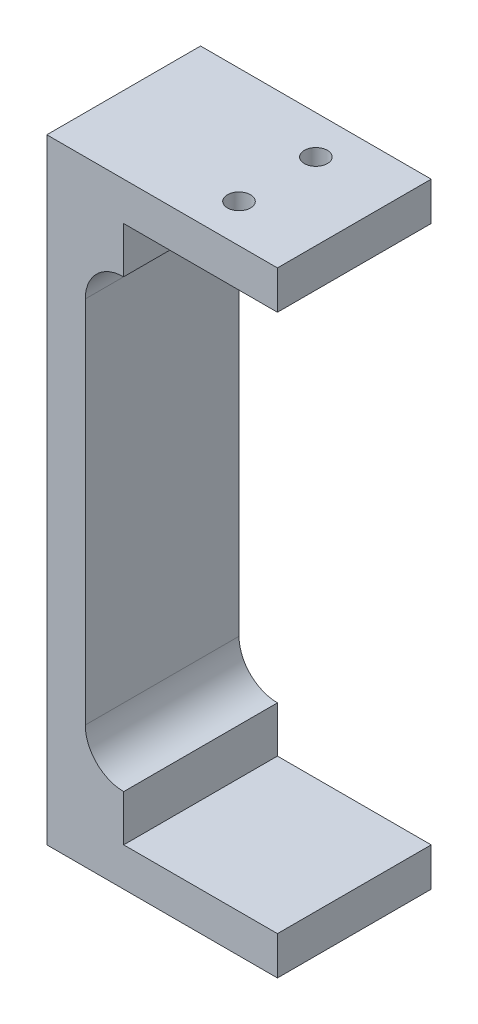
ISO-10303-21;
HEADER;
FILE_DESCRIPTION(('STEP AP214'),'2;1');
FILE_NAME('part.step','',(''),(''),'','','');
FILE_SCHEMA(('AUTOMOTIVE_DESIGN { 1 0 10303 214 1 1 1 1 }'));
ENDSEC;
DATA;
#1=APPLICATION_CONTEXT('core data for automotive mechanical design processes');
#2=APPLICATION_PROTOCOL_DEFINITION('international standard','automotive_design',2000,#1);
#3=PRODUCT_CONTEXT('',#1,'mechanical');
#4=PRODUCT('Part','Part','',(#3));
#5=PRODUCT_RELATED_PRODUCT_CATEGORY('part','',(#4));
#6=PRODUCT_DEFINITION_FORMATION('','',#4);
#7=PRODUCT_DEFINITION_CONTEXT('part definition',#1,'design');
#8=PRODUCT_DEFINITION('design','',#6,#7);
#9=PRODUCT_DEFINITION_SHAPE('','',#8);
#10=(LENGTH_UNIT() NAMED_UNIT(*) SI_UNIT(.MILLI.,.METRE.));
#11=(NAMED_UNIT(*) PLANE_ANGLE_UNIT() SI_UNIT($,.RADIAN.));
#12=(NAMED_UNIT(*) SI_UNIT($,.STERADIAN.) SOLID_ANGLE_UNIT());
#13=UNCERTAINTY_MEASURE_WITH_UNIT(LENGTH_MEASURE(1.E-05),#10,'distance_accuracy_value','');
#14=(GEOMETRIC_REPRESENTATION_CONTEXT(3) GLOBAL_UNCERTAINTY_ASSIGNED_CONTEXT((#13)) GLOBAL_UNIT_ASSIGNED_CONTEXT((#10,
#11,#12)) REPRESENTATION_CONTEXT('',''));
#15=CARTESIAN_POINT('',(0.,0.,0.));
#16=DIRECTION('',(0.,0.,1.));
#17=DIRECTION('',(1.,0.,0.));
#18=AXIS2_PLACEMENT_3D('',#15,#16,#17);
#19=CARTESIAN_POINT('',(20.,-75.,20.));
#20=DIRECTION('',(0.,-1.,0.));
#21=DIRECTION('',(0.,0.,-1.));
#22=AXIS2_PLACEMENT_3D('',#19,#20,#21);
#23=PLANE('',#22);
#24=DIRECTION('',(0.,0.,-1.));
#25=VECTOR('',#24,1.);
#26=CARTESIAN_POINT('',(0.,-75.,20.));
#27=LINE('',#26,#25);
#28=CARTESIAN_POINT('',(0.,-75.,20.));
#29=VERTEX_POINT('',#28);
#30=CARTESIAN_POINT('',(0.,-75.,0.));
#31=VERTEX_POINT('',#30);
#32=EDGE_CURVE('E54',#29,#31,#27,.T.);
#33=ORIENTED_EDGE('',*,*,#32,.F.);
#34=DIRECTION('',(-1.,0.,0.));
#35=VECTOR('',#34,1.);
#36=CARTESIAN_POINT('',(20.,-75.,20.));
#37=LINE('',#36,#35);
#38=CARTESIAN_POINT('',(20.,-75.,20.));
#39=VERTEX_POINT('',#38);
#40=EDGE_CURVE('E134',#39,#29,#37,.T.);
#41=ORIENTED_EDGE('',*,*,#40,.F.);
#42=DIRECTION('',(0.,0.,-1.));
#43=VECTOR('',#42,1.);
#44=CARTESIAN_POINT('',(20.,-75.,20.));
#45=LINE('',#44,#43);
#46=CARTESIAN_POINT('',(20.,-75.,0.));
#47=VERTEX_POINT('',#46);
#48=EDGE_CURVE('E211',#39,#47,#45,.T.);
#49=ORIENTED_EDGE('',*,*,#48,.T.);
#50=DIRECTION('',(-1.,0.,0.));
#51=VECTOR('',#50,1.);
#52=CARTESIAN_POINT('',(20.,-75.,0.));
#53=LINE('',#52,#51);
#54=EDGE_CURVE('E204',#47,#31,#53,.T.);
#55=ORIENTED_EDGE('',*,*,#54,.T.);
#56=EDGE_LOOP('',(#33,#41,#49,#55));
#57=FACE_BOUND('',#56,.T.);
#58=ADVANCED_FACE('F39',(#57),#23,.F.);
#59=CARTESIAN_POINT('',(-5.,-75.,20.));
#60=DIRECTION('',(-1.,0.,0.));
#61=DIRECTION('',(0.,0.,1.));
#62=AXIS2_PLACEMENT_3D('',#59,#60,#61);
#63=PLANE('',#62);
#64=DIRECTION('',(0.,1.,0.));
#65=VECTOR('',#64,1.);
#66=CARTESIAN_POINT('',(-5.,-75.,20.));
#67=LINE('',#66,#65);
#68=CARTESIAN_POINT('',(-5.,-64.,20.));
#69=VERTEX_POINT('',#68);
#70=CARTESIAN_POINT('',(-5.,-16.,20.));
#71=VERTEX_POINT('',#70);
#72=EDGE_CURVE('E62',#69,#71,#67,.T.);
#73=ORIENTED_EDGE('',*,*,#72,.F.);
#74=DIRECTION('',(0.,0.,-1.));
#75=VECTOR('',#74,1.);
#76=CARTESIAN_POINT('',(-5.,-64.,20.));
#77=LINE('',#76,#75);
#78=CARTESIAN_POINT('',(-5.,-64.,0.));
#79=VERTEX_POINT('',#78);
#80=EDGE_CURVE('E146',#69,#79,#77,.T.);
#81=ORIENTED_EDGE('',*,*,#80,.T.);
#82=DIRECTION('',(0.,1.,0.));
#83=VECTOR('',#82,1.);
#84=CARTESIAN_POINT('',(-5.,-75.,0.));
#85=LINE('',#84,#83);
#86=CARTESIAN_POINT('',(-5.,-16.,0.));
#87=VERTEX_POINT('',#86);
#88=EDGE_CURVE('E206',#79,#87,#85,.T.);
#89=ORIENTED_EDGE('',*,*,#88,.T.);
#90=DIRECTION('',(0.,0.,-1.));
#91=VECTOR('',#90,1.);
#92=CARTESIAN_POINT('',(-5.,-16.,20.));
#93=LINE('',#92,#91);
#94=EDGE_CURVE('E173',#71,#87,#93,.T.);
#95=ORIENTED_EDGE('',*,*,#94,.F.);
#96=EDGE_LOOP('',(#73,#81,#89,#95));
#97=FACE_BOUND('',#96,.T.);
#98=ADVANCED_FACE('F259',(#97),#63,.F.);
#99=CARTESIAN_POINT('',(-5.,-5.,20.));
#100=DIRECTION('',(0.,1.,0.));
#101=DIRECTION('',(0.,0.,1.));
#102=AXIS2_PLACEMENT_3D('',#99,#100,#101);
#103=PLANE('',#102);
#104=CARTESIAN_POINT('',(9.99999999999999,-5.,5.));
#105=DIRECTION('',(0.,1.,0.));
#106=DIRECTION('',(0.,0.,1.));
#107=AXIS2_PLACEMENT_3D('',#104,#105,#106);
#108=CIRCLE('',#107,1.5);
#109=CARTESIAN_POINT('',(9.99999999999999,-5.,6.5));
#110=VERTEX_POINT('',#109);
#111=EDGE_CURVE('E154',#110,#110,#108,.F.);
#112=ORIENTED_EDGE('',*,*,#111,.F.);
#113=EDGE_LOOP('',(#112));
#114=FACE_BOUND('',#113,.T.);
#115=CARTESIAN_POINT('',(9.99999999999999,-5.,15.));
#116=DIRECTION('',(0.,1.,0.));
#117=DIRECTION('',(0.,0.,1.));
#118=AXIS2_PLACEMENT_3D('',#115,#116,#117);
#119=CIRCLE('',#118,1.5);
#120=CARTESIAN_POINT('',(9.99999999999999,-5.,16.5));
#121=VERTEX_POINT('',#120);
#122=EDGE_CURVE('E289',#121,#121,#119,.F.);
#123=ORIENTED_EDGE('',*,*,#122,.F.);
#124=EDGE_LOOP('',(#123));
#125=FACE_BOUND('',#124,.T.);
#126=DIRECTION('',(0.,0.,-1.));
#127=VECTOR('',#126,1.);
#128=CARTESIAN_POINT('',(0.,-5.,20.));
#129=LINE('',#128,#127);
#130=CARTESIAN_POINT('',(0.,-5.,20.));
#131=VERTEX_POINT('',#130);
#132=CARTESIAN_POINT('',(0.,-5.,0.));
#133=VERTEX_POINT('',#132);
#134=EDGE_CURVE('E164',#131,#133,#129,.T.);
#135=ORIENTED_EDGE('',*,*,#134,.T.);
#136=DIRECTION('',(1.,0.,0.));
#137=VECTOR('',#136,1.);
#138=CARTESIAN_POINT('',(-5.,-5.,0.));
#139=LINE('',#138,#137);
#140=CARTESIAN_POINT('',(20.,-5.,0.));
#141=VERTEX_POINT('',#140);
#142=EDGE_CURVE('E181',#133,#141,#139,.T.);
#143=ORIENTED_EDGE('',*,*,#142,.T.);
#144=DIRECTION('',(0.,0.,-1.));
#145=VECTOR('',#144,1.);
#146=CARTESIAN_POINT('',(20.,-5.,20.));
#147=LINE('',#146,#145);
#148=CARTESIAN_POINT('',(20.,-5.,20.));
#149=VERTEX_POINT('',#148);
#150=EDGE_CURVE('E193',#149,#141,#147,.T.);
#151=ORIENTED_EDGE('',*,*,#150,.F.);
#152=DIRECTION('',(1.,0.,0.));
#153=VECTOR('',#152,1.);
#154=CARTESIAN_POINT('',(-5.,-5.,20.));
#155=LINE('',#154,#153);
#156=EDGE_CURVE('E191',#131,#149,#155,.T.);
#157=ORIENTED_EDGE('',*,*,#156,.F.);
#158=EDGE_LOOP('',(#135,#143,#151,#157));
#159=FACE_BOUND('',#158,.T.);
#160=ADVANCED_FACE('F251',(#114,#125,#159),#103,.F.);
#161=CARTESIAN_POINT('',(20.,-5.,20.));
#162=DIRECTION('',(-1.,0.,0.));
#163=DIRECTION('',(0.,0.,1.));
#164=AXIS2_PLACEMENT_3D('',#161,#162,#163);
#165=PLANE('',#164);
#166=DIRECTION('',(0.,1.,0.));
#167=VECTOR('',#166,1.);
#168=CARTESIAN_POINT('',(20.,-5.,0.));
#169=LINE('',#168,#167);
#170=CARTESIAN_POINT('',(20.,0.,0.));
#171=VERTEX_POINT('',#170);
#172=EDGE_CURVE('E176',#141,#171,#169,.T.);
#173=ORIENTED_EDGE('',*,*,#172,.T.);
#174=DIRECTION('',(0.,0.,-1.));
#175=VECTOR('',#174,1.);
#176=CARTESIAN_POINT('',(20.,0.,20.));
#177=LINE('',#176,#175);
#178=CARTESIAN_POINT('',(20.,0.,20.));
#179=VERTEX_POINT('',#178);
#180=EDGE_CURVE('E11',#179,#171,#177,.T.);
#181=ORIENTED_EDGE('',*,*,#180,.F.);
#182=DIRECTION('',(0.,1.,0.));
#183=VECTOR('',#182,1.);
#184=CARTESIAN_POINT('',(20.,-5.,20.));
#185=LINE('',#184,#183);
#186=EDGE_CURVE('E177',#149,#179,#185,.T.);
#187=ORIENTED_EDGE('',*,*,#186,.F.);
#188=ORIENTED_EDGE('',*,*,#150,.T.);
#189=EDGE_LOOP('',(#173,#181,#187,#188));
#190=FACE_BOUND('',#189,.T.);
#191=ADVANCED_FACE('F41',(#190),#165,.F.);
#192=CARTESIAN_POINT('',(20.,0.,20.));
#193=DIRECTION('',(0.,-1.,0.));
#194=DIRECTION('',(1.,0.,0.));
#195=AXIS2_PLACEMENT_3D('',#192,#193,#194);
#196=PLANE('',#195);
#197=CARTESIAN_POINT('',(9.99999999999999,0.,5.));
#198=DIRECTION('',(0.,1.,0.));
#199=DIRECTION('',(0.,0.,1.));
#200=AXIS2_PLACEMENT_3D('',#197,#198,#199);
#201=CIRCLE('',#200,1.5);
#202=CARTESIAN_POINT('',(9.99999999999999,0.,6.5));
#203=VERTEX_POINT('',#202);
#204=EDGE_CURVE('E284',#203,#203,#201,.T.);
#205=ORIENTED_EDGE('',*,*,#204,.F.);
#206=EDGE_LOOP('',(#205));
#207=FACE_BOUND('',#206,.T.);
#208=CARTESIAN_POINT('',(9.99999999999999,0.,15.));
#209=DIRECTION('',(0.,1.,0.));
#210=DIRECTION('',(0.,0.,1.));
#211=AXIS2_PLACEMENT_3D('',#208,#209,#210);
#212=CIRCLE('',#211,1.5);
#213=CARTESIAN_POINT('',(9.99999999999999,0.,16.5));
#214=VERTEX_POINT('',#213);
#215=EDGE_CURVE('E287',#214,#214,#212,.T.);
#216=ORIENTED_EDGE('',*,*,#215,.F.);
#217=EDGE_LOOP('',(#216));
#218=FACE_BOUND('',#217,.T.);
#219=DIRECTION('',(-1.,0.,0.));
#220=VECTOR('',#219,1.);
#221=CARTESIAN_POINT('',(20.,0.,0.));
#222=LINE('',#221,#220);
#223=CARTESIAN_POINT('',(-10.,0.,0.));
#224=VERTEX_POINT('',#223);
#225=EDGE_CURVE('E196',#171,#224,#222,.T.);
#226=ORIENTED_EDGE('',*,*,#225,.T.);
#227=DIRECTION('',(0.,0.,-1.));
#228=VECTOR('',#227,1.);
#229=CARTESIAN_POINT('',(-10.,0.,20.));
#230=LINE('',#229,#228);
#231=CARTESIAN_POINT('',(-10.,0.,20.));
#232=VERTEX_POINT('',#231);
#233=EDGE_CURVE('E47',#232,#224,#230,.T.);
#234=ORIENTED_EDGE('',*,*,#233,.F.);
#235=DIRECTION('',(-1.,0.,0.));
#236=VECTOR('',#235,1.);
#237=CARTESIAN_POINT('',(20.,0.,20.));
#238=LINE('',#237,#236);
#239=EDGE_CURVE('E180',#179,#232,#238,.T.);
#240=ORIENTED_EDGE('',*,*,#239,.F.);
#241=ORIENTED_EDGE('',*,*,#180,.T.);
#242=EDGE_LOOP('',(#226,#234,#240,#241));
#243=FACE_BOUND('',#242,.T.);
#244=ADVANCED_FACE('F244',(#207,#218,#243),#196,.F.);
#245=CARTESIAN_POINT('',(-10.,0.,20.));
#246=DIRECTION('',(1.,0.,0.));
#247=DIRECTION('',(0.,1.,0.));
#248=AXIS2_PLACEMENT_3D('',#245,#246,#247);
#249=PLANE('',#248);
#250=DIRECTION('',(0.,-1.,0.));
#251=VECTOR('',#250,1.);
#252=CARTESIAN_POINT('',(-10.,0.,0.));
#253=LINE('',#252,#251);
#254=CARTESIAN_POINT('',(-9.99999999999999,-80.,0.));
#255=VERTEX_POINT('',#254);
#256=EDGE_CURVE('E198',#224,#255,#253,.T.);
#257=ORIENTED_EDGE('',*,*,#256,.T.);
#258=DIRECTION('',(0.,0.,-1.));
#259=VECTOR('',#258,1.);
#260=CARTESIAN_POINT('',(-9.99999999999999,-80.,20.));
#261=LINE('',#260,#259);
#262=CARTESIAN_POINT('',(-9.99999999999999,-80.,20.));
#263=VERTEX_POINT('',#262);
#264=EDGE_CURVE('E217',#263,#255,#261,.T.);
#265=ORIENTED_EDGE('',*,*,#264,.F.);
#266=DIRECTION('',(0.,-1.,0.));
#267=VECTOR('',#266,1.);
#268=CARTESIAN_POINT('',(-10.,0.,20.));
#269=LINE('',#268,#267);
#270=EDGE_CURVE('E183',#232,#263,#269,.T.);
#271=ORIENTED_EDGE('',*,*,#270,.F.);
#272=ORIENTED_EDGE('',*,*,#233,.T.);
#273=EDGE_LOOP('',(#257,#265,#271,#272));
#274=FACE_BOUND('',#273,.T.);
#275=ADVANCED_FACE('F224',(#274),#249,.F.);
#276=CARTESIAN_POINT('',(-9.99999999999999,-80.,20.));
#277=DIRECTION('',(0.,1.,0.));
#278=DIRECTION('',(0.,0.,1.));
#279=AXIS2_PLACEMENT_3D('',#276,#277,#278);
#280=PLANE('',#279);
#281=DIRECTION('',(1.,0.,0.));
#282=VECTOR('',#281,1.);
#283=CARTESIAN_POINT('',(-9.99999999999999,-80.,0.));
#284=LINE('',#283,#282);
#285=CARTESIAN_POINT('',(20.,-80.,0.));
#286=VERTEX_POINT('',#285);
#287=EDGE_CURVE('E200',#255,#286,#284,.T.);
#288=ORIENTED_EDGE('',*,*,#287,.T.);
#289=DIRECTION('',(0.,0.,-1.));
#290=VECTOR('',#289,1.);
#291=CARTESIAN_POINT('',(20.,-80.,20.));
#292=LINE('',#291,#290);
#293=CARTESIAN_POINT('',(20.,-80.,20.));
#294=VERTEX_POINT('',#293);
#295=EDGE_CURVE('E214',#294,#286,#292,.T.);
#296=ORIENTED_EDGE('',*,*,#295,.F.);
#297=DIRECTION('',(1.,0.,0.));
#298=VECTOR('',#297,1.);
#299=CARTESIAN_POINT('',(-9.99999999999999,-80.,20.));
#300=LINE('',#299,#298);
#301=EDGE_CURVE('E185',#263,#294,#300,.T.);
#302=ORIENTED_EDGE('',*,*,#301,.F.);
#303=ORIENTED_EDGE('',*,*,#264,.T.);
#304=EDGE_LOOP('',(#288,#296,#302,#303));
#305=FACE_BOUND('',#304,.T.);
#306=ADVANCED_FACE('F236',(#305),#280,.F.);
#307=CARTESIAN_POINT('',(20.,-80.,20.));
#308=DIRECTION('',(-1.,0.,0.));
#309=DIRECTION('',(0.,0.,1.));
#310=AXIS2_PLACEMENT_3D('',#307,#308,#309);
#311=PLANE('',#310);
#312=DIRECTION('',(0.,1.,0.));
#313=VECTOR('',#312,1.);
#314=CARTESIAN_POINT('',(20.,-80.,0.));
#315=LINE('',#314,#313);
#316=EDGE_CURVE('E202',#286,#47,#315,.T.);
#317=ORIENTED_EDGE('',*,*,#316,.T.);
#318=ORIENTED_EDGE('',*,*,#48,.F.);
#319=DIRECTION('',(0.,1.,0.));
#320=VECTOR('',#319,1.);
#321=CARTESIAN_POINT('',(20.,-80.,20.));
#322=LINE('',#321,#320);
#323=EDGE_CURVE('E187',#294,#39,#322,.T.);
#324=ORIENTED_EDGE('',*,*,#323,.F.);
#325=ORIENTED_EDGE('',*,*,#295,.T.);
#326=EDGE_LOOP('',(#317,#318,#324,#325));
#327=FACE_BOUND('',#326,.T.);
#328=ADVANCED_FACE('F240',(#327),#311,.F.);
#329=CARTESIAN_POINT('',(0.,0.,20.));
#330=DIRECTION('',(0.,0.,1.));
#331=DIRECTION('',(1.,0.,0.));
#332=AXIS2_PLACEMENT_3D('',#329,#330,#331);
#333=PLANE('',#332);
#334=CARTESIAN_POINT('',(0.,-64.,20.));
#335=DIRECTION('',(0.,0.,-1.));
#336=DIRECTION('',(-1.,0.,0.));
#337=AXIS2_PLACEMENT_3D('',#334,#335,#336);
#338=CIRCLE('',#337,5.);
#339=CARTESIAN_POINT('',(0.,-69.,20.));
#340=VERTEX_POINT('',#339);
#341=EDGE_CURVE('E132',#340,#69,#338,.T.);
#342=ORIENTED_EDGE('',*,*,#341,.T.);
#343=ORIENTED_EDGE('',*,*,#72,.T.);
#344=CARTESIAN_POINT('',(0.,-16.,20.));
#345=DIRECTION('',(0.,0.,-1.));
#346=DIRECTION('',(1.,0.,0.));
#347=AXIS2_PLACEMENT_3D('',#344,#345,#346);
#348=CIRCLE('',#347,5.);
#349=CARTESIAN_POINT('',(0.,-11.,20.));
#350=VERTEX_POINT('',#349);
#351=EDGE_CURVE('E158',#71,#350,#348,.T.);
#352=ORIENTED_EDGE('',*,*,#351,.T.);
#353=DIRECTION('',(0.,1.,0.));
#354=VECTOR('',#353,1.);
#355=CARTESIAN_POINT('',(0.,-5.,20.));
#356=LINE('',#355,#354);
#357=EDGE_CURVE('E160',#350,#131,#356,.T.);
#358=ORIENTED_EDGE('',*,*,#357,.T.);
#359=ORIENTED_EDGE('',*,*,#156,.T.);
#360=ORIENTED_EDGE('',*,*,#186,.T.);
#361=ORIENTED_EDGE('',*,*,#239,.T.);
#362=ORIENTED_EDGE('',*,*,#270,.T.);
#363=ORIENTED_EDGE('',*,*,#301,.T.);
#364=ORIENTED_EDGE('',*,*,#323,.T.);
#365=ORIENTED_EDGE('',*,*,#40,.T.);
#366=DIRECTION('',(0.,1.,0.));
#367=VECTOR('',#366,1.);
#368=CARTESIAN_POINT('',(0.,-75.,20.));
#369=LINE('',#368,#367);
#370=EDGE_CURVE('E128',#29,#340,#369,.T.);
#371=ORIENTED_EDGE('',*,*,#370,.T.);
#372=EDGE_LOOP('',(#342,#343,#352,#358,#359,#360,#361,#362,#363,#364,#365,#371));
#373=FACE_BOUND('',#372,.T.);
#374=ADVANCED_FACE('F130',(#373),#333,.T.);
#375=CARTESIAN_POINT('',(0.,0.,0.));
#376=DIRECTION('',(0.,0.,1.));
#377=DIRECTION('',(1.,0.,0.));
#378=AXIS2_PLACEMENT_3D('',#375,#376,#377);
#379=PLANE('',#378);
#380=ORIENTED_EDGE('',*,*,#88,.F.);
#381=CARTESIAN_POINT('',(0.,-64.,0.));
#382=DIRECTION('',(0.,0.,-1.));
#383=DIRECTION('',(-1.,0.,0.));
#384=AXIS2_PLACEMENT_3D('',#381,#382,#383);
#385=CIRCLE('',#384,5.);
#386=CARTESIAN_POINT('',(0.,-69.,0.));
#387=VERTEX_POINT('',#386);
#388=EDGE_CURVE('E136',#387,#79,#385,.T.);
#389=ORIENTED_EDGE('',*,*,#388,.F.);
#390=DIRECTION('',(0.,1.,0.));
#391=VECTOR('',#390,1.);
#392=CARTESIAN_POINT('',(0.,-75.,0.));
#393=LINE('',#392,#391);
#394=EDGE_CURVE('E142',#31,#387,#393,.T.);
#395=ORIENTED_EDGE('',*,*,#394,.F.);
#396=ORIENTED_EDGE('',*,*,#54,.F.);
#397=ORIENTED_EDGE('',*,*,#316,.F.);
#398=ORIENTED_EDGE('',*,*,#287,.F.);
#399=ORIENTED_EDGE('',*,*,#256,.F.);
#400=ORIENTED_EDGE('',*,*,#225,.F.);
#401=ORIENTED_EDGE('',*,*,#172,.F.);
#402=ORIENTED_EDGE('',*,*,#142,.F.);
#403=DIRECTION('',(0.,1.,0.));
#404=VECTOR('',#403,1.);
#405=CARTESIAN_POINT('',(0.,-5.,0.));
#406=LINE('',#405,#404);
#407=CARTESIAN_POINT('',(0.,-11.,0.));
#408=VERTEX_POINT('',#407);
#409=EDGE_CURVE('E161',#408,#133,#406,.T.);
#410=ORIENTED_EDGE('',*,*,#409,.F.);
#411=CARTESIAN_POINT('',(0.,-16.,0.));
#412=DIRECTION('',(0.,0.,-1.));
#413=DIRECTION('',(1.,0.,0.));
#414=AXIS2_PLACEMENT_3D('',#411,#412,#413);
#415=CIRCLE('',#414,5.);
#416=EDGE_CURVE('E157',#87,#408,#415,.T.);
#417=ORIENTED_EDGE('',*,*,#416,.F.);
#418=EDGE_LOOP('',(#380,#389,#395,#396,#397,#398,#399,#400,#401,#402,#410,#417));
#419=FACE_BOUND('',#418,.T.);
#420=ADVANCED_FACE('F230',(#419),#379,.F.);
#421=CARTESIAN_POINT('',(0.,-16.,20.));
#422=DIRECTION('',(0.,0.,-1.));
#423=DIRECTION('',(-1.,0.,0.));
#424=AXIS2_PLACEMENT_3D('',#421,#422,#423);
#425=CYLINDRICAL_SURFACE('',#424,5.);
#426=ORIENTED_EDGE('',*,*,#416,.T.);
#427=DIRECTION('',(0.,0.,-1.));
#428=VECTOR('',#427,1.);
#429=CARTESIAN_POINT('',(0.,-11.,20.));
#430=LINE('',#429,#428);
#431=EDGE_CURVE('E170',#350,#408,#430,.T.);
#432=ORIENTED_EDGE('',*,*,#431,.F.);
#433=ORIENTED_EDGE('',*,*,#351,.F.);
#434=ORIENTED_EDGE('',*,*,#94,.T.);
#435=EDGE_LOOP('',(#426,#432,#433,#434));
#436=FACE_BOUND('',#435,.T.);
#437=ADVANCED_FACE('F258',(#436),#425,.F.);
#438=CARTESIAN_POINT('',(0.,-5.,20.));
#439=DIRECTION('',(-1.,0.,0.));
#440=DIRECTION('',(0.,-1.,0.));
#441=AXIS2_PLACEMENT_3D('',#438,#439,#440);
#442=PLANE('',#441);
#443=ORIENTED_EDGE('',*,*,#409,.T.);
#444=ORIENTED_EDGE('',*,*,#134,.F.);
#445=ORIENTED_EDGE('',*,*,#357,.F.);
#446=ORIENTED_EDGE('',*,*,#431,.T.);
#447=EDGE_LOOP('',(#443,#444,#445,#446));
#448=FACE_BOUND('',#447,.T.);
#449=ADVANCED_FACE('F254',(#448),#442,.F.);
#450=CARTESIAN_POINT('',(0.,-75.,20.));
#451=DIRECTION('',(-1.,0.,0.));
#452=DIRECTION('',(0.,-1.,0.));
#453=AXIS2_PLACEMENT_3D('',#450,#451,#452);
#454=PLANE('',#453);
#455=ORIENTED_EDGE('',*,*,#394,.T.);
#456=DIRECTION('',(0.,0.,-1.));
#457=VECTOR('',#456,1.);
#458=CARTESIAN_POINT('',(0.,-69.,20.));
#459=LINE('',#458,#457);
#460=EDGE_CURVE('E139',#340,#387,#459,.T.);
#461=ORIENTED_EDGE('',*,*,#460,.F.);
#462=ORIENTED_EDGE('',*,*,#370,.F.);
#463=ORIENTED_EDGE('',*,*,#32,.T.);
#464=EDGE_LOOP('',(#455,#461,#462,#463));
#465=FACE_BOUND('',#464,.T.);
#466=ADVANCED_FACE('F140',(#465),#454,.F.);
#467=CARTESIAN_POINT('',(0.,-64.,20.));
#468=DIRECTION('',(0.,0.,-1.));
#469=DIRECTION('',(-1.,0.,0.));
#470=AXIS2_PLACEMENT_3D('',#467,#468,#469);
#471=CYLINDRICAL_SURFACE('',#470,5.);
#472=ORIENTED_EDGE('',*,*,#388,.T.);
#473=ORIENTED_EDGE('',*,*,#80,.F.);
#474=ORIENTED_EDGE('',*,*,#341,.F.);
#475=ORIENTED_EDGE('',*,*,#460,.T.);
#476=EDGE_LOOP('',(#472,#473,#474,#475));
#477=FACE_BOUND('',#476,.T.);
#478=ADVANCED_FACE('F148',(#477),#471,.F.);
#479=CARTESIAN_POINT('',(9.99999999999999,-9.24264068711928,15.));
#480=DIRECTION('',(0.,1.,0.));
#481=DIRECTION('',(0.,0.,1.));
#482=AXIS2_PLACEMENT_3D('',#479,#480,#481);
#483=CYLINDRICAL_SURFACE('',#482,1.5);
#484=ORIENTED_EDGE('',*,*,#122,.T.);
#485=EDGE_LOOP('',(#484));
#486=FACE_BOUND('',#485,.T.);
#487=ORIENTED_EDGE('',*,*,#215,.T.);
#488=EDGE_LOOP('',(#487));
#489=FACE_BOUND('',#488,.T.);
#490=ADVANCED_FACE('F298',(#486,#489),#483,.F.);
#491=CARTESIAN_POINT('',(9.99999999999999,-9.24264068711928,5.));
#492=DIRECTION('',(0.,1.,0.));
#493=DIRECTION('',(0.,0.,1.));
#494=AXIS2_PLACEMENT_3D('',#491,#492,#493);
#495=CYLINDRICAL_SURFACE('',#494,1.5);
#496=ORIENTED_EDGE('',*,*,#111,.T.);
#497=EDGE_LOOP('',(#496));
#498=FACE_BOUND('',#497,.T.);
#499=ORIENTED_EDGE('',*,*,#204,.T.);
#500=EDGE_LOOP('',(#499));
#501=FACE_BOUND('',#500,.T.);
#502=ADVANCED_FACE('F296',(#498,#501),#495,.F.);
#503=CLOSED_SHELL('',(#58,#98,#160,#191,#244,#275,#306,#328,#374,#420,#437,#449,#466,#478,#490,#502));
#504=MANIFOLD_SOLID_BREP('B2',#503);
#505=ADVANCED_BREP_SHAPE_REPRESENTATION('',(#18,#504),#14);
#506=SHAPE_DEFINITION_REPRESENTATION(#9,#505);
ENDSEC;
END-ISO-10303-21;
